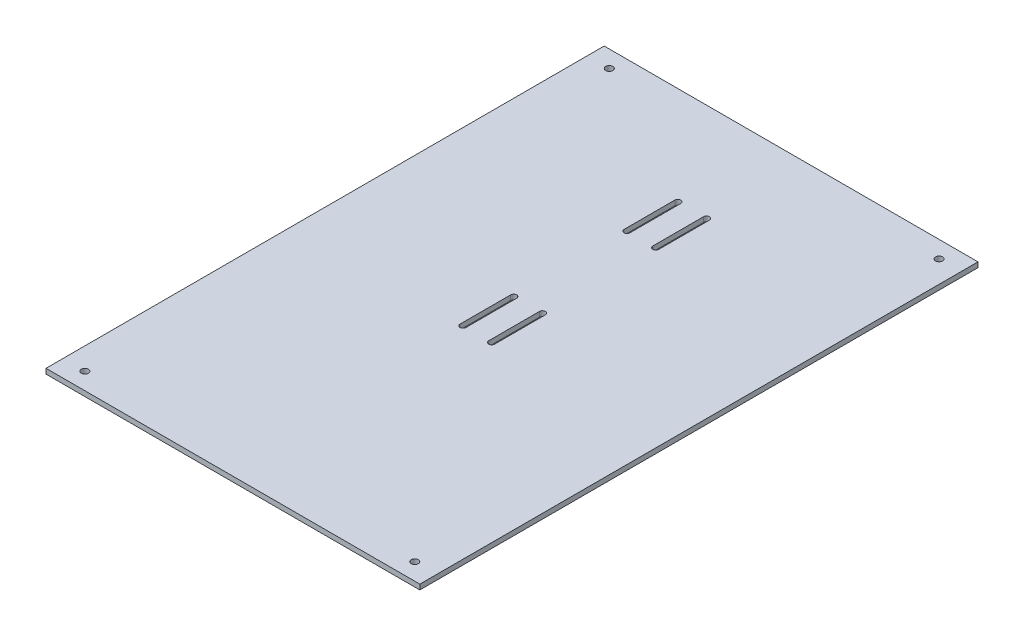
ISO-10303-21;
HEADER;
FILE_DESCRIPTION(('STEP AP214'),'2;1');
FILE_NAME('part.step','',(''),(''),'','','');
FILE_SCHEMA(('AUTOMOTIVE_DESIGN { 1 0 10303 214 1 1 1 1 }'));
ENDSEC;
DATA;
#1=APPLICATION_CONTEXT('core data for automotive mechanical design processes');
#2=APPLICATION_PROTOCOL_DEFINITION('international standard','automotive_design',2000,#1);
#3=PRODUCT_CONTEXT('',#1,'mechanical');
#4=PRODUCT('Part','Part','',(#3));
#5=PRODUCT_RELATED_PRODUCT_CATEGORY('part','',(#4));
#6=PRODUCT_DEFINITION_FORMATION('','',#4);
#7=PRODUCT_DEFINITION_CONTEXT('part definition',#1,'design');
#8=PRODUCT_DEFINITION('design','',#6,#7);
#9=PRODUCT_DEFINITION_SHAPE('','',#8);
#10=(LENGTH_UNIT() NAMED_UNIT(*) SI_UNIT(.MILLI.,.METRE.));
#11=(NAMED_UNIT(*) PLANE_ANGLE_UNIT() SI_UNIT($,.RADIAN.));
#12=(NAMED_UNIT(*) SI_UNIT($,.STERADIAN.) SOLID_ANGLE_UNIT());
#13=UNCERTAINTY_MEASURE_WITH_UNIT(LENGTH_MEASURE(1.E-05),#10,'distance_accuracy_value','');
#14=(GEOMETRIC_REPRESENTATION_CONTEXT(3) GLOBAL_UNCERTAINTY_ASSIGNED_CONTEXT((#13)) GLOBAL_UNIT_ASSIGNED_CONTEXT((#10,
#11,#12)) REPRESENTATION_CONTEXT('',''));
#15=CARTESIAN_POINT('',(0.,0.,0.));
#16=DIRECTION('',(0.,0.,1.));
#17=DIRECTION('',(1.,0.,0.));
#18=AXIS2_PLACEMENT_3D('',#15,#16,#17);
#19=CARTESIAN_POINT('',(110.5,-13.,207.5));
#20=DIRECTION('',(0.,1.,0.));
#21=DIRECTION('',(0.,0.,1.));
#22=AXIS2_PLACEMENT_3D('',#19,#20,#21);
#23=PLANE('',#22);
#24=CARTESIAN_POINT('',(97.5,-13.,-112.5));
#25=DIRECTION('',(0.,-1.,0.));
#26=DIRECTION('',(0.,0.,-1.));
#27=AXIS2_PLACEMENT_3D('',#24,#25,#26);
#28=CIRCLE('',#27,2.1);
#29=CARTESIAN_POINT('',(97.5,-13.,-114.6));
#30=VERTEX_POINT('',#29);
#31=EDGE_CURVE('E218',#30,#30,#28,.T.);
#32=ORIENTED_EDGE('',*,*,#31,.F.);
#33=EDGE_LOOP('',(#32));
#34=FACE_BOUND('',#33,.T.);
#35=DIRECTION('',(0.,0.,-1.));
#36=VECTOR('',#35,1.);
#37=CARTESIAN_POINT('',(-10.7431705127637,-13.,62.5));
#38=LINE('',#37,#36);
#39=CARTESIAN_POINT('',(-10.7431705127637,-13.,62.5));
#40=VERTEX_POINT('',#39);
#41=CARTESIAN_POINT('',(-10.7431705127637,-13.,32.5));
#42=VERTEX_POINT('',#41);
#43=EDGE_CURVE('E202',#40,#42,#38,.T.);
#44=ORIENTED_EDGE('',*,*,#43,.F.);
#45=CARTESIAN_POINT('',(-8.9931705127637,-13.,62.5));
#46=DIRECTION('',(0.,-1.,0.));
#47=DIRECTION('',(0.,0.,-1.));
#48=AXIS2_PLACEMENT_3D('',#45,#46,#47);
#49=CIRCLE('',#48,1.75);
#50=CARTESIAN_POINT('',(-7.2431705127637,-13.,62.5));
#51=VERTEX_POINT('',#50);
#52=EDGE_CURVE('E57',#51,#40,#49,.T.);
#53=ORIENTED_EDGE('',*,*,#52,.F.);
#54=DIRECTION('',(0.,0.,1.));
#55=VECTOR('',#54,1.);
#56=CARTESIAN_POINT('',(-7.2431705127637,-13.,62.5));
#57=LINE('',#56,#55);
#58=CARTESIAN_POINT('',(-7.2431705127637,-13.,32.5));
#59=VERTEX_POINT('',#58);
#60=EDGE_CURVE('E195',#59,#51,#57,.T.);
#61=ORIENTED_EDGE('',*,*,#60,.F.);
#62=CARTESIAN_POINT('',(-8.9931705127637,-13.,32.5));
#63=DIRECTION('',(0.,-1.,0.));
#64=DIRECTION('',(0.,0.,-1.));
#65=AXIS2_PLACEMENT_3D('',#62,#63,#64);
#66=CIRCLE('',#65,1.75);
#67=EDGE_CURVE('E209',#42,#59,#66,.T.);
#68=ORIENTED_EDGE('',*,*,#67,.F.);
#69=EDGE_LOOP('',(#44,#53,#61,#68));
#70=FACE_BOUND('',#69,.T.);
#71=DIRECTION('',(0.,0.,-1.));
#72=VECTOR('',#71,1.);
#73=CARTESIAN_POINT('',(6.25682948723529,-13.,62.4999999999998));
#74=LINE('',#73,#72);
#75=CARTESIAN_POINT('',(6.25682948723529,-13.,62.4999999999998));
#76=VERTEX_POINT('',#75);
#77=CARTESIAN_POINT('',(6.25682948723529,-13.,32.4999999999998));
#78=VERTEX_POINT('',#77);
#79=EDGE_CURVE('E268',#76,#78,#74,.T.);
#80=ORIENTED_EDGE('',*,*,#79,.F.);
#81=CARTESIAN_POINT('',(8.00682948723529,-13.,62.4999999999998));
#82=DIRECTION('',(0.,-1.,0.));
#83=DIRECTION('',(0.,0.,-1.));
#84=AXIS2_PLACEMENT_3D('',#81,#82,#83);
#85=CIRCLE('',#84,1.74999999999999);
#86=CARTESIAN_POINT('',(9.75682948723527,-13.,62.4999999999998));
#87=VERTEX_POINT('',#86);
#88=EDGE_CURVE('E65',#87,#76,#85,.T.);
#89=ORIENTED_EDGE('',*,*,#88,.F.);
#90=DIRECTION('',(0.,0.,1.));
#91=VECTOR('',#90,1.);
#92=CARTESIAN_POINT('',(9.75682948723527,-13.,62.4999999999998));
#93=LINE('',#92,#91);
#94=CARTESIAN_POINT('',(9.75682948723527,-13.,32.4999999999998));
#95=VERTEX_POINT('',#94);
#96=EDGE_CURVE('E274',#95,#87,#93,.T.);
#97=ORIENTED_EDGE('',*,*,#96,.F.);
#98=CARTESIAN_POINT('',(8.00682948723529,-13.,32.4999999999998));
#99=DIRECTION('',(0.,-1.,0.));
#100=DIRECTION('',(0.,0.,-1.));
#101=AXIS2_PLACEMENT_3D('',#98,#99,#100);
#102=CIRCLE('',#101,1.74999999999999);
#103=EDGE_CURVE('E271',#78,#95,#102,.T.);
#104=ORIENTED_EDGE('',*,*,#103,.F.);
#105=EDGE_LOOP('',(#80,#89,#97,#104));
#106=FACE_BOUND('',#105,.T.);
#107=DIRECTION('',(0.,0.,-1.));
#108=VECTOR('',#107,1.);
#109=CARTESIAN_POINT('',(6.25682948723529,-13.,-34.5000000000001));
#110=LINE('',#109,#108);
#111=CARTESIAN_POINT('',(6.25682948723529,-13.,-34.5000000000001));
#112=VERTEX_POINT('',#111);
#113=CARTESIAN_POINT('',(6.2568294872353,-13.,-64.5000000000001));
#114=VERTEX_POINT('',#113);
#115=EDGE_CURVE('E237',#112,#114,#110,.T.);
#116=ORIENTED_EDGE('',*,*,#115,.F.);
#117=CARTESIAN_POINT('',(8.00682948723529,-13.,-34.5000000000001));
#118=DIRECTION('',(0.,-1.,0.));
#119=DIRECTION('',(0.,0.,-1.));
#120=AXIS2_PLACEMENT_3D('',#117,#118,#119);
#121=CIRCLE('',#120,1.75);
#122=CARTESIAN_POINT('',(9.75682948723529,-13.,-34.5000000000001));
#123=VERTEX_POINT('',#122);
#124=EDGE_CURVE('E235',#123,#112,#121,.T.);
#125=ORIENTED_EDGE('',*,*,#124,.F.);
#126=DIRECTION('',(0.,0.,1.));
#127=VECTOR('',#126,1.);
#128=CARTESIAN_POINT('',(9.75682948723529,-13.,-34.5000000000001));
#129=LINE('',#128,#127);
#130=CARTESIAN_POINT('',(9.75682948723529,-13.,-64.5000000000001));
#131=VERTEX_POINT('',#130);
#132=EDGE_CURVE('E243',#131,#123,#129,.T.);
#133=ORIENTED_EDGE('',*,*,#132,.F.);
#134=CARTESIAN_POINT('',(8.0068294872353,-13.,-64.5000000000001));
#135=DIRECTION('',(0.,-1.,0.));
#136=DIRECTION('',(0.,0.,-1.));
#137=AXIS2_PLACEMENT_3D('',#134,#135,#136);
#138=CIRCLE('',#137,1.75);
#139=EDGE_CURVE('E240',#114,#131,#138,.T.);
#140=ORIENTED_EDGE('',*,*,#139,.F.);
#141=EDGE_LOOP('',(#116,#125,#133,#140));
#142=FACE_BOUND('',#141,.T.);
#143=CARTESIAN_POINT('',(-97.5,-13.,197.5));
#144=DIRECTION('',(0.,-1.,0.));
#145=DIRECTION('',(0.,0.,-1.));
#146=AXIS2_PLACEMENT_3D('',#143,#144,#145);
#147=CIRCLE('',#146,2.1);
#148=CARTESIAN_POINT('',(-97.5,-13.,195.4));
#149=VERTEX_POINT('',#148);
#150=EDGE_CURVE('E393',#149,#149,#147,.T.);
#151=ORIENTED_EDGE('',*,*,#150,.F.);
#152=EDGE_LOOP('',(#151));
#153=FACE_BOUND('',#152,.T.);
#154=CARTESIAN_POINT('',(97.5,-13.,197.5));
#155=DIRECTION('',(0.,-1.,0.));
#156=DIRECTION('',(0.,0.,-1.));
#157=AXIS2_PLACEMENT_3D('',#154,#155,#156);
#158=CIRCLE('',#157,2.1);
#159=CARTESIAN_POINT('',(97.5,-13.,195.4));
#160=VERTEX_POINT('',#159);
#161=EDGE_CURVE('E397',#160,#160,#158,.T.);
#162=ORIENTED_EDGE('',*,*,#161,.F.);
#163=EDGE_LOOP('',(#162));
#164=FACE_BOUND('',#163,.T.);
#165=CARTESIAN_POINT('',(-97.5,-13.,-112.5));
#166=DIRECTION('',(0.,-1.,0.));
#167=DIRECTION('',(0.,0.,-1.));
#168=AXIS2_PLACEMENT_3D('',#165,#166,#167);
#169=CIRCLE('',#168,2.1);
#170=CARTESIAN_POINT('',(-97.5,-13.,-114.6));
#171=VERTEX_POINT('',#170);
#172=EDGE_CURVE('E224',#171,#171,#169,.T.);
#173=ORIENTED_EDGE('',*,*,#172,.F.);
#174=EDGE_LOOP('',(#173));
#175=FACE_BOUND('',#174,.T.);
#176=DIRECTION('',(0.,0.,-1.));
#177=VECTOR('',#176,1.);
#178=CARTESIAN_POINT('',(-10.7431705127637,-13.,-34.4999999999999));
#179=LINE('',#178,#177);
#180=CARTESIAN_POINT('',(-10.7431705127637,-13.,-34.5));
#181=VERTEX_POINT('',#180);
#182=CARTESIAN_POINT('',(-10.7431705127637,-13.,-64.4999999999999));
#183=VERTEX_POINT('',#182);
#184=EDGE_CURVE('E297',#181,#183,#179,.T.);
#185=ORIENTED_EDGE('',*,*,#184,.F.);
#186=CARTESIAN_POINT('',(-8.9931705127637,-13.,-34.4999999999999));
#187=DIRECTION('',(0.,-1.,0.));
#188=DIRECTION('',(0.,0.,-1.));
#189=AXIS2_PLACEMENT_3D('',#186,#187,#188);
#190=CIRCLE('',#189,1.75);
#191=CARTESIAN_POINT('',(-7.2431705127637,-13.,-34.4999999999999));
#192=VERTEX_POINT('',#191);
#193=EDGE_CURVE('E295',#192,#181,#190,.T.);
#194=ORIENTED_EDGE('',*,*,#193,.F.);
#195=DIRECTION('',(0.,0.,1.));
#196=VECTOR('',#195,1.);
#197=CARTESIAN_POINT('',(-7.2431705127637,-13.,-34.4999999999999));
#198=LINE('',#197,#196);
#199=CARTESIAN_POINT('',(-7.2431705127637,-13.,-64.4999999999999));
#200=VERTEX_POINT('',#199);
#201=EDGE_CURVE('E303',#200,#192,#198,.T.);
#202=ORIENTED_EDGE('',*,*,#201,.F.);
#203=CARTESIAN_POINT('',(-8.9931705127637,-13.,-64.4999999999999));
#204=DIRECTION('',(0.,-1.,0.));
#205=DIRECTION('',(0.,0.,-1.));
#206=AXIS2_PLACEMENT_3D('',#203,#204,#205);
#207=CIRCLE('',#206,1.75);
#208=EDGE_CURVE('E300',#183,#200,#207,.T.);
#209=ORIENTED_EDGE('',*,*,#208,.F.);
#210=EDGE_LOOP('',(#185,#194,#202,#209));
#211=FACE_BOUND('',#210,.T.);
#212=DIRECTION('',(-1.,0.,0.));
#213=VECTOR('',#212,1.);
#214=CARTESIAN_POINT('',(110.5,-13.,207.5));
#215=LINE('',#214,#213);
#216=CARTESIAN_POINT('',(110.5,-13.,207.5));
#217=VERTEX_POINT('',#216);
#218=CARTESIAN_POINT('',(-110.5,-13.,207.5));
#219=VERTEX_POINT('',#218);
#220=EDGE_CURVE('E341',#217,#219,#215,.T.);
#221=ORIENTED_EDGE('',*,*,#220,.T.);
#222=DIRECTION('',(0.,0.,-1.));
#223=VECTOR('',#222,1.);
#224=CARTESIAN_POINT('',(-110.5,-13.,207.5));
#225=LINE('',#224,#223);
#226=CARTESIAN_POINT('',(-110.5,-13.,-122.5));
#227=VERTEX_POINT('',#226);
#228=EDGE_CURVE('E318',#219,#227,#225,.T.);
#229=ORIENTED_EDGE('',*,*,#228,.T.);
#230=DIRECTION('',(-1.,0.,0.));
#231=VECTOR('',#230,1.);
#232=CARTESIAN_POINT('',(110.5,-13.,-122.5));
#233=LINE('',#232,#231);
#234=CARTESIAN_POINT('',(110.5,-13.,-122.5));
#235=VERTEX_POINT('',#234);
#236=EDGE_CURVE('E11',#235,#227,#233,.T.);
#237=ORIENTED_EDGE('',*,*,#236,.F.);
#238=DIRECTION('',(0.,0.,-1.));
#239=VECTOR('',#238,1.);
#240=CARTESIAN_POINT('',(110.5,-13.,207.5));
#241=LINE('',#240,#239);
#242=EDGE_CURVE('E330',#217,#235,#241,.T.);
#243=ORIENTED_EDGE('',*,*,#242,.F.);
#244=EDGE_LOOP('',(#221,#229,#237,#243));
#245=FACE_BOUND('',#244,.T.);
#246=ADVANCED_FACE('F43',(#34,#70,#106,#142,#153,#164,#175,#211,#245),#23,.F.);
#247=CARTESIAN_POINT('',(110.5,-10.,-122.5));
#248=DIRECTION('',(0.,0.,-1.));
#249=DIRECTION('',(0.,1.,0.));
#250=AXIS2_PLACEMENT_3D('',#247,#248,#249);
#251=PLANE('',#250);
#252=ORIENTED_EDGE('',*,*,#236,.T.);
#253=DIRECTION('',(0.,-1.,0.));
#254=VECTOR('',#253,1.);
#255=CARTESIAN_POINT('',(-110.5,-10.,-122.5));
#256=LINE('',#255,#254);
#257=CARTESIAN_POINT('',(-110.5,-10.,-122.5));
#258=VERTEX_POINT('',#257);
#259=EDGE_CURVE('E321',#258,#227,#256,.T.);
#260=ORIENTED_EDGE('',*,*,#259,.F.);
#261=DIRECTION('',(-1.,0.,0.));
#262=VECTOR('',#261,1.);
#263=CARTESIAN_POINT('',(110.5,-10.,-122.5));
#264=LINE('',#263,#262);
#265=CARTESIAN_POINT('',(110.5,-10.,-122.5));
#266=VERTEX_POINT('',#265);
#267=EDGE_CURVE('E50',#266,#258,#264,.T.);
#268=ORIENTED_EDGE('',*,*,#267,.F.);
#269=DIRECTION('',(0.,-1.,0.));
#270=VECTOR('',#269,1.);
#271=CARTESIAN_POINT('',(110.5,-10.,-122.5));
#272=LINE('',#271,#270);
#273=EDGE_CURVE('E332',#266,#235,#272,.T.);
#274=ORIENTED_EDGE('',*,*,#273,.T.);
#275=EDGE_LOOP('',(#252,#260,#268,#274));
#276=FACE_BOUND('',#275,.T.);
#277=ADVANCED_FACE('F354',(#276),#251,.T.);
#278=CARTESIAN_POINT('',(110.5,-10.,207.5));
#279=DIRECTION('',(0.,1.,0.));
#280=DIRECTION('',(0.,0.,1.));
#281=AXIS2_PLACEMENT_3D('',#278,#279,#280);
#282=PLANE('',#281);
#283=CARTESIAN_POINT('',(97.5,-10.,-112.5));
#284=DIRECTION('',(0.,1.,0.));
#285=DIRECTION('',(0.,0.,1.));
#286=AXIS2_PLACEMENT_3D('',#283,#284,#285);
#287=CIRCLE('',#286,2.1);
#288=CARTESIAN_POINT('',(97.5,-10.,-110.4));
#289=VERTEX_POINT('',#288);
#290=EDGE_CURVE('E221',#289,#289,#287,.F.);
#291=ORIENTED_EDGE('',*,*,#290,.T.);
#292=EDGE_LOOP('',(#291));
#293=FACE_BOUND('',#292,.T.);
#294=CARTESIAN_POINT('',(-8.9931705127637,-10.,62.5));
#295=DIRECTION('',(0.,1.,0.));
#296=DIRECTION('',(0.,0.,1.));
#297=AXIS2_PLACEMENT_3D('',#294,#295,#296);
#298=CIRCLE('',#297,1.75);
#299=CARTESIAN_POINT('',(-7.2431705127637,-10.,62.5));
#300=VERTEX_POINT('',#299);
#301=CARTESIAN_POINT('',(-10.7431705127637,-10.,62.5));
#302=VERTEX_POINT('',#301);
#303=EDGE_CURVE('E193',#300,#302,#298,.F.);
#304=ORIENTED_EDGE('',*,*,#303,.T.);
#305=DIRECTION('',(0.,0.,-1.));
#306=VECTOR('',#305,1.);
#307=CARTESIAN_POINT('',(-10.7431705127637,-10.,62.5));
#308=LINE('',#307,#306);
#309=CARTESIAN_POINT('',(-10.7431705127637,-10.,32.5));
#310=VERTEX_POINT('',#309);
#311=EDGE_CURVE('E179',#302,#310,#308,.T.);
#312=ORIENTED_EDGE('',*,*,#311,.T.);
#313=CARTESIAN_POINT('',(-8.9931705127637,-10.,32.5));
#314=DIRECTION('',(0.,1.,0.));
#315=DIRECTION('',(0.,0.,1.));
#316=AXIS2_PLACEMENT_3D('',#313,#314,#315);
#317=CIRCLE('',#316,1.75);
#318=CARTESIAN_POINT('',(-7.2431705127637,-10.,32.5));
#319=VERTEX_POINT('',#318);
#320=EDGE_CURVE('E204',#310,#319,#317,.F.);
#321=ORIENTED_EDGE('',*,*,#320,.T.);
#322=DIRECTION('',(0.,0.,1.));
#323=VECTOR('',#322,1.);
#324=CARTESIAN_POINT('',(-7.2431705127637,-10.,62.5));
#325=LINE('',#324,#323);
#326=EDGE_CURVE('E200',#319,#300,#325,.T.);
#327=ORIENTED_EDGE('',*,*,#326,.T.);
#328=EDGE_LOOP('',(#304,#312,#321,#327));
#329=FACE_BOUND('',#328,.T.);
#330=CARTESIAN_POINT('',(8.00682948723529,-10.,62.4999999999998));
#331=DIRECTION('',(0.,1.,0.));
#332=DIRECTION('',(0.,0.,1.));
#333=AXIS2_PLACEMENT_3D('',#330,#331,#332);
#334=CIRCLE('',#333,1.74999999999999);
#335=CARTESIAN_POINT('',(9.75682948723527,-10.,62.4999999999998));
#336=VERTEX_POINT('',#335);
#337=CARTESIAN_POINT('',(6.25682948723529,-10.,62.4999999999998));
#338=VERTEX_POINT('',#337);
#339=EDGE_CURVE('E264',#336,#338,#334,.F.);
#340=ORIENTED_EDGE('',*,*,#339,.T.);
#341=DIRECTION('',(0.,0.,-1.));
#342=VECTOR('',#341,1.);
#343=CARTESIAN_POINT('',(6.25682948723529,-10.,62.4999999999998));
#344=LINE('',#343,#342);
#345=CARTESIAN_POINT('',(6.25682948723529,-10.,32.4999999999998));
#346=VERTEX_POINT('',#345);
#347=EDGE_CURVE('E229',#338,#346,#344,.T.);
#348=ORIENTED_EDGE('',*,*,#347,.T.);
#349=CARTESIAN_POINT('',(8.00682948723529,-10.,32.4999999999998));
#350=DIRECTION('',(0.,1.,0.));
#351=DIRECTION('',(0.,0.,1.));
#352=AXIS2_PLACEMENT_3D('',#349,#350,#351);
#353=CIRCLE('',#352,1.74999999999999);
#354=CARTESIAN_POINT('',(9.75682948723528,-10.,32.4999999999998));
#355=VERTEX_POINT('',#354);
#356=EDGE_CURVE('E189',#346,#355,#353,.F.);
#357=ORIENTED_EDGE('',*,*,#356,.T.);
#358=DIRECTION('',(0.,0.,1.));
#359=VECTOR('',#358,1.);
#360=CARTESIAN_POINT('',(9.75682948723527,-10.,62.4999999999998));
#361=LINE('',#360,#359);
#362=EDGE_CURVE('E261',#355,#336,#361,.T.);
#363=ORIENTED_EDGE('',*,*,#362,.T.);
#364=EDGE_LOOP('',(#340,#348,#357,#363));
#365=FACE_BOUND('',#364,.T.);
#366=CARTESIAN_POINT('',(8.00682948723529,-10.,-34.5000000000001));
#367=DIRECTION('',(0.,1.,0.));
#368=DIRECTION('',(0.,0.,1.));
#369=AXIS2_PLACEMENT_3D('',#366,#367,#368);
#370=CIRCLE('',#369,1.75);
#371=CARTESIAN_POINT('',(9.75682948723529,-10.,-34.5000000000001));
#372=VERTEX_POINT('',#371);
#373=CARTESIAN_POINT('',(6.25682948723529,-10.,-34.5000000000001));
#374=VERTEX_POINT('',#373);
#375=EDGE_CURVE('E232',#372,#374,#370,.F.);
#376=ORIENTED_EDGE('',*,*,#375,.T.);
#377=DIRECTION('',(0.,0.,-1.));
#378=VECTOR('',#377,1.);
#379=CARTESIAN_POINT('',(6.25682948723529,-10.,-34.5000000000001));
#380=LINE('',#379,#378);
#381=CARTESIAN_POINT('',(6.25682948723528,-10.,-64.5000000000001));
#382=VERTEX_POINT('',#381);
#383=EDGE_CURVE('E249',#374,#382,#380,.T.);
#384=ORIENTED_EDGE('',*,*,#383,.T.);
#385=CARTESIAN_POINT('',(8.0068294872353,-10.,-64.5000000000001));
#386=DIRECTION('',(0.,1.,0.));
#387=DIRECTION('',(0.,0.,1.));
#388=AXIS2_PLACEMENT_3D('',#385,#386,#387);
#389=CIRCLE('',#388,1.75);
#390=CARTESIAN_POINT('',(9.7568294872353,-10.,-64.5000000000001));
#391=VERTEX_POINT('',#390);
#392=EDGE_CURVE('E225',#382,#391,#389,.F.);
#393=ORIENTED_EDGE('',*,*,#392,.T.);
#394=DIRECTION('',(0.,0.,1.));
#395=VECTOR('',#394,1.);
#396=CARTESIAN_POINT('',(9.75682948723529,-10.,-34.5000000000001));
#397=LINE('',#396,#395);
#398=EDGE_CURVE('E228',#391,#372,#397,.T.);
#399=ORIENTED_EDGE('',*,*,#398,.T.);
#400=EDGE_LOOP('',(#376,#384,#393,#399));
#401=FACE_BOUND('',#400,.T.);
#402=CARTESIAN_POINT('',(-97.5,-10.,197.5));
#403=DIRECTION('',(0.,1.,0.));
#404=DIRECTION('',(0.,0.,1.));
#405=AXIS2_PLACEMENT_3D('',#402,#403,#404);
#406=CIRCLE('',#405,2.1);
#407=CARTESIAN_POINT('',(-97.5,-10.,199.6));
#408=VERTEX_POINT('',#407);
#409=EDGE_CURVE('E690',#408,#408,#406,.F.);
#410=ORIENTED_EDGE('',*,*,#409,.T.);
#411=EDGE_LOOP('',(#410));
#412=FACE_BOUND('',#411,.T.);
#413=CARTESIAN_POINT('',(97.5,-10.,197.5));
#414=DIRECTION('',(0.,1.,0.));
#415=DIRECTION('',(0.,0.,1.));
#416=AXIS2_PLACEMENT_3D('',#413,#414,#415);
#417=CIRCLE('',#416,2.1);
#418=CARTESIAN_POINT('',(97.5,-10.,199.6));
#419=VERTEX_POINT('',#418);
#420=EDGE_CURVE('E682',#419,#419,#417,.F.);
#421=ORIENTED_EDGE('',*,*,#420,.T.);
#422=EDGE_LOOP('',(#421));
#423=FACE_BOUND('',#422,.T.);
#424=CARTESIAN_POINT('',(-97.5,-10.,-112.5));
#425=DIRECTION('',(0.,1.,0.));
#426=DIRECTION('',(0.,0.,1.));
#427=AXIS2_PLACEMENT_3D('',#424,#425,#426);
#428=CIRCLE('',#427,2.1);
#429=CARTESIAN_POINT('',(-97.5,-10.,-110.4));
#430=VERTEX_POINT('',#429);
#431=EDGE_CURVE('E686',#430,#430,#428,.F.);
#432=ORIENTED_EDGE('',*,*,#431,.T.);
#433=EDGE_LOOP('',(#432));
#434=FACE_BOUND('',#433,.T.);
#435=CARTESIAN_POINT('',(-8.9931705127637,-10.,-34.4999999999999));
#436=DIRECTION('',(0.,1.,0.));
#437=DIRECTION('',(0.,0.,1.));
#438=AXIS2_PLACEMENT_3D('',#435,#436,#437);
#439=CIRCLE('',#438,1.75);
#440=CARTESIAN_POINT('',(-7.2431705127637,-10.,-34.4999999999999));
#441=VERTEX_POINT('',#440);
#442=CARTESIAN_POINT('',(-10.7431705127637,-10.,-34.4999999999999));
#443=VERTEX_POINT('',#442);
#444=EDGE_CURVE('E292',#441,#443,#439,.F.);
#445=ORIENTED_EDGE('',*,*,#444,.T.);
#446=DIRECTION('',(0.,0.,-1.));
#447=VECTOR('',#446,1.);
#448=CARTESIAN_POINT('',(-10.7431705127637,-10.,-34.4999999999999));
#449=LINE('',#448,#447);
#450=CARTESIAN_POINT('',(-10.7431705127637,-10.,-64.5));
#451=VERTEX_POINT('',#450);
#452=EDGE_CURVE('E309',#443,#451,#449,.T.);
#453=ORIENTED_EDGE('',*,*,#452,.T.);
#454=CARTESIAN_POINT('',(-8.9931705127637,-10.,-64.4999999999999));
#455=DIRECTION('',(0.,1.,0.));
#456=DIRECTION('',(0.,0.,1.));
#457=AXIS2_PLACEMENT_3D('',#454,#455,#456);
#458=CIRCLE('',#457,1.75);
#459=CARTESIAN_POINT('',(-7.2431705127637,-10.,-64.4999999999999));
#460=VERTEX_POINT('',#459);
#461=EDGE_CURVE('E258',#451,#460,#458,.F.);
#462=ORIENTED_EDGE('',*,*,#461,.T.);
#463=DIRECTION('',(0.,0.,1.));
#464=VECTOR('',#463,1.);
#465=CARTESIAN_POINT('',(-7.2431705127637,-10.,-34.4999999999999));
#466=LINE('',#465,#464);
#467=EDGE_CURVE('E289',#460,#441,#466,.T.);
#468=ORIENTED_EDGE('',*,*,#467,.T.);
#469=EDGE_LOOP('',(#445,#453,#462,#468));
#470=FACE_BOUND('',#469,.T.);
#471=ORIENTED_EDGE('',*,*,#267,.T.);
#472=DIRECTION('',(0.,0.,-1.));
#473=VECTOR('',#472,1.);
#474=CARTESIAN_POINT('',(-110.5,-10.,207.5));
#475=LINE('',#474,#473);
#476=CARTESIAN_POINT('',(-110.5,-10.,207.5));
#477=VERTEX_POINT('',#476);
#478=EDGE_CURVE('E324',#477,#258,#475,.T.);
#479=ORIENTED_EDGE('',*,*,#478,.F.);
#480=DIRECTION('',(-1.,0.,0.));
#481=VECTOR('',#480,1.);
#482=CARTESIAN_POINT('',(110.5,-10.,207.5));
#483=LINE('',#482,#481);
#484=CARTESIAN_POINT('',(110.5,-10.,207.5));
#485=VERTEX_POINT('',#484);
#486=EDGE_CURVE('E343',#485,#477,#483,.T.);
#487=ORIENTED_EDGE('',*,*,#486,.F.);
#488=DIRECTION('',(0.,0.,-1.));
#489=VECTOR('',#488,1.);
#490=CARTESIAN_POINT('',(110.5,-10.,207.5));
#491=LINE('',#490,#489);
#492=EDGE_CURVE('E335',#485,#266,#491,.T.);
#493=ORIENTED_EDGE('',*,*,#492,.T.);
#494=EDGE_LOOP('',(#471,#479,#487,#493));
#495=FACE_BOUND('',#494,.T.);
#496=ADVANCED_FACE('F198',(#293,#329,#365,#401,#412,#423,#434,#470,#495),#282,.T.);
#497=CARTESIAN_POINT('',(110.5,-13.,207.5));
#498=DIRECTION('',(0.,0.,1.));
#499=DIRECTION('',(1.,0.,0.));
#500=AXIS2_PLACEMENT_3D('',#497,#498,#499);
#501=PLANE('',#500);
#502=ORIENTED_EDGE('',*,*,#486,.T.);
#503=DIRECTION('',(0.,1.,0.));
#504=VECTOR('',#503,1.);
#505=CARTESIAN_POINT('',(-110.5,-13.,207.5));
#506=LINE('',#505,#504);
#507=EDGE_CURVE('E327',#219,#477,#506,.T.);
#508=ORIENTED_EDGE('',*,*,#507,.F.);
#509=ORIENTED_EDGE('',*,*,#220,.F.);
#510=DIRECTION('',(0.,1.,0.));
#511=VECTOR('',#510,1.);
#512=CARTESIAN_POINT('',(110.5,-13.,207.5));
#513=LINE('',#512,#511);
#514=EDGE_CURVE('E338',#217,#485,#513,.T.);
#515=ORIENTED_EDGE('',*,*,#514,.T.);
#516=EDGE_LOOP('',(#502,#508,#509,#515));
#517=FACE_BOUND('',#516,.T.);
#518=ADVANCED_FACE('F360',(#517),#501,.T.);
#519=CARTESIAN_POINT('',(110.5,0.,0.));
#520=DIRECTION('',(-1.,0.,0.));
#521=DIRECTION('',(0.,0.,1.));
#522=AXIS2_PLACEMENT_3D('',#519,#520,#521);
#523=PLANE('',#522);
#524=ORIENTED_EDGE('',*,*,#242,.T.);
#525=ORIENTED_EDGE('',*,*,#273,.F.);
#526=ORIENTED_EDGE('',*,*,#492,.F.);
#527=ORIENTED_EDGE('',*,*,#514,.F.);
#528=EDGE_LOOP('',(#524,#525,#526,#527));
#529=FACE_BOUND('',#528,.T.);
#530=ADVANCED_FACE('F362',(#529),#523,.F.);
#531=CARTESIAN_POINT('',(-110.5,0.,0.));
#532=DIRECTION('',(-1.,0.,0.));
#533=DIRECTION('',(0.,0.,1.));
#534=AXIS2_PLACEMENT_3D('',#531,#532,#533);
#535=PLANE('',#534);
#536=ORIENTED_EDGE('',*,*,#228,.F.);
#537=ORIENTED_EDGE('',*,*,#507,.T.);
#538=ORIENTED_EDGE('',*,*,#478,.T.);
#539=ORIENTED_EDGE('',*,*,#259,.T.);
#540=EDGE_LOOP('',(#536,#537,#538,#539));
#541=FACE_BOUND('',#540,.T.);
#542=ADVANCED_FACE('F352',(#541),#535,.T.);
#543=CARTESIAN_POINT('',(-8.9931705127637,-9.99900000000001,-34.4999999999999));
#544=DIRECTION('',(0.,-1.,0.));
#545=DIRECTION('',(0.,0.,-1.));
#546=AXIS2_PLACEMENT_3D('',#543,#544,#545);
#547=CYLINDRICAL_SURFACE('',#546,1.75);
#548=DIRECTION('',(0.,-1.,0.));
#549=VECTOR('',#548,1.);
#550=CARTESIAN_POINT('',(-7.2431705127637,-9.99900000000001,-34.4999999999999));
#551=LINE('',#550,#549);
#552=EDGE_CURVE('E307',#441,#192,#551,.T.);
#553=ORIENTED_EDGE('',*,*,#552,.T.);
#554=ORIENTED_EDGE('',*,*,#193,.T.);
#555=DIRECTION('',(0.,-1.,0.));
#556=VECTOR('',#555,1.);
#557=CARTESIAN_POINT('',(-10.7431705127637,-9.99900000000001,-34.4999999999999));
#558=LINE('',#557,#556);
#559=EDGE_CURVE('E306',#443,#181,#558,.T.);
#560=ORIENTED_EDGE('',*,*,#559,.F.);
#561=ORIENTED_EDGE('',*,*,#444,.F.);
#562=EDGE_LOOP('',(#553,#554,#560,#561));
#563=FACE_BOUND('',#562,.T.);
#564=ADVANCED_FACE('F369',(#563),#547,.F.);
#565=CARTESIAN_POINT('',(-7.2431705127637,-9.99900000000001,-34.4999999999999));
#566=DIRECTION('',(1.,0.,0.));
#567=DIRECTION('',(0.,0.,-1.));
#568=AXIS2_PLACEMENT_3D('',#565,#566,#567);
#569=PLANE('',#568);
#570=DIRECTION('',(0.,-1.,0.));
#571=VECTOR('',#570,1.);
#572=CARTESIAN_POINT('',(-7.2431705127637,-9.99900000000001,-64.4999999999999));
#573=LINE('',#572,#571);
#574=EDGE_CURVE('E310',#460,#200,#573,.T.);
#575=ORIENTED_EDGE('',*,*,#574,.T.);
#576=ORIENTED_EDGE('',*,*,#201,.T.);
#577=ORIENTED_EDGE('',*,*,#552,.F.);
#578=ORIENTED_EDGE('',*,*,#467,.F.);
#579=EDGE_LOOP('',(#575,#576,#577,#578));
#580=FACE_BOUND('',#579,.T.);
#581=ADVANCED_FACE('F414',(#580),#569,.F.);
#582=CARTESIAN_POINT('',(-8.9931705127637,-9.99900000000001,-64.4999999999999));
#583=DIRECTION('',(0.,-1.,0.));
#584=DIRECTION('',(0.,0.,-1.));
#585=AXIS2_PLACEMENT_3D('',#582,#583,#584);
#586=CYLINDRICAL_SURFACE('',#585,1.75);
#587=DIRECTION('',(0.,-1.,0.));
#588=VECTOR('',#587,1.);
#589=CARTESIAN_POINT('',(-10.7431705127637,-9.99900000000001,-64.4999999999999));
#590=LINE('',#589,#588);
#591=EDGE_CURVE('E312',#451,#183,#590,.T.);
#592=ORIENTED_EDGE('',*,*,#591,.T.);
#593=ORIENTED_EDGE('',*,*,#208,.T.);
#594=ORIENTED_EDGE('',*,*,#574,.F.);
#595=ORIENTED_EDGE('',*,*,#461,.F.);
#596=EDGE_LOOP('',(#592,#593,#594,#595));
#597=FACE_BOUND('',#596,.T.);
#598=ADVANCED_FACE('F416',(#597),#586,.F.);
#599=CARTESIAN_POINT('',(-10.7431705127637,-9.99900000000001,-34.4999999999999));
#600=DIRECTION('',(-1.,0.,0.));
#601=DIRECTION('',(0.,0.,1.));
#602=AXIS2_PLACEMENT_3D('',#599,#600,#601);
#603=PLANE('',#602);
#604=ORIENTED_EDGE('',*,*,#559,.T.);
#605=ORIENTED_EDGE('',*,*,#184,.T.);
#606=ORIENTED_EDGE('',*,*,#591,.F.);
#607=ORIENTED_EDGE('',*,*,#452,.F.);
#608=EDGE_LOOP('',(#604,#605,#606,#607));
#609=FACE_BOUND('',#608,.T.);
#610=ADVANCED_FACE('F406',(#609),#603,.F.);
#611=CARTESIAN_POINT('',(-97.5,-9.99900000000001,-112.5));
#612=DIRECTION('',(0.,-1.,0.));
#613=DIRECTION('',(0.,0.,-1.));
#614=AXIS2_PLACEMENT_3D('',#611,#612,#613);
#615=CYLINDRICAL_SURFACE('',#614,2.1);
#616=ORIENTED_EDGE('',*,*,#431,.F.);
#617=EDGE_LOOP('',(#616));
#618=FACE_BOUND('',#617,.T.);
#619=ORIENTED_EDGE('',*,*,#172,.T.);
#620=EDGE_LOOP('',(#619));
#621=FACE_BOUND('',#620,.T.);
#622=ADVANCED_FACE('F423',(#618,#621),#615,.F.);
#623=CARTESIAN_POINT('',(97.5,-9.99900000000001,197.5));
#624=DIRECTION('',(0.,-1.,0.));
#625=DIRECTION('',(0.,0.,-1.));
#626=AXIS2_PLACEMENT_3D('',#623,#624,#625);
#627=CYLINDRICAL_SURFACE('',#626,2.1);
#628=ORIENTED_EDGE('',*,*,#420,.F.);
#629=EDGE_LOOP('',(#628));
#630=FACE_BOUND('',#629,.T.);
#631=ORIENTED_EDGE('',*,*,#161,.T.);
#632=EDGE_LOOP('',(#631));
#633=FACE_BOUND('',#632,.T.);
#634=ADVANCED_FACE('F458',(#630,#633),#627,.F.);
#635=CARTESIAN_POINT('',(-97.5,-9.99900000000001,197.5));
#636=DIRECTION('',(0.,-1.,0.));
#637=DIRECTION('',(0.,0.,-1.));
#638=AXIS2_PLACEMENT_3D('',#635,#636,#637);
#639=CYLINDRICAL_SURFACE('',#638,2.1);
#640=ORIENTED_EDGE('',*,*,#409,.F.);
#641=EDGE_LOOP('',(#640));
#642=FACE_BOUND('',#641,.T.);
#643=ORIENTED_EDGE('',*,*,#150,.T.);
#644=EDGE_LOOP('',(#643));
#645=FACE_BOUND('',#644,.T.);
#646=ADVANCED_FACE('F469',(#642,#645),#639,.F.);
#647=CARTESIAN_POINT('',(8.00682948723529,-9.99900000000001,-34.5000000000001));
#648=DIRECTION('',(0.,-1.,0.));
#649=DIRECTION('',(0.,0.,-1.));
#650=AXIS2_PLACEMENT_3D('',#647,#648,#649);
#651=CYLINDRICAL_SURFACE('',#650,1.75);
#652=DIRECTION('',(0.,-1.,0.));
#653=VECTOR('',#652,1.);
#654=CARTESIAN_POINT('',(9.75682948723529,-9.99900000000001,-34.5000000000001));
#655=LINE('',#654,#653);
#656=EDGE_CURVE('E247',#372,#123,#655,.T.);
#657=ORIENTED_EDGE('',*,*,#656,.T.);
#658=ORIENTED_EDGE('',*,*,#124,.T.);
#659=DIRECTION('',(0.,-1.,0.));
#660=VECTOR('',#659,1.);
#661=CARTESIAN_POINT('',(6.25682948723529,-9.99900000000001,-34.5000000000001));
#662=LINE('',#661,#660);
#663=EDGE_CURVE('E246',#374,#112,#662,.T.);
#664=ORIENTED_EDGE('',*,*,#663,.F.);
#665=ORIENTED_EDGE('',*,*,#375,.F.);
#666=EDGE_LOOP('',(#657,#658,#664,#665));
#667=FACE_BOUND('',#666,.T.);
#668=ADVANCED_FACE('F480',(#667),#651,.F.);
#669=CARTESIAN_POINT('',(9.75682948723529,-9.99900000000001,-34.5000000000001));
#670=DIRECTION('',(1.,0.,0.));
#671=DIRECTION('',(0.,0.,-1.));
#672=AXIS2_PLACEMENT_3D('',#669,#670,#671);
#673=PLANE('',#672);
#674=DIRECTION('',(0.,-1.,0.));
#675=VECTOR('',#674,1.);
#676=CARTESIAN_POINT('',(9.75682948723529,-9.99900000000001,-64.5000000000001));
#677=LINE('',#676,#675);
#678=EDGE_CURVE('E250',#391,#131,#677,.T.);
#679=ORIENTED_EDGE('',*,*,#678,.T.);
#680=ORIENTED_EDGE('',*,*,#132,.T.);
#681=ORIENTED_EDGE('',*,*,#656,.F.);
#682=ORIENTED_EDGE('',*,*,#398,.F.);
#683=EDGE_LOOP('',(#679,#680,#681,#682));
#684=FACE_BOUND('',#683,.T.);
#685=ADVANCED_FACE('F491',(#684),#673,.F.);
#686=CARTESIAN_POINT('',(8.0068294872353,-9.99900000000001,-64.5000000000001));
#687=DIRECTION('',(0.,-1.,0.));
#688=DIRECTION('',(0.,0.,-1.));
#689=AXIS2_PLACEMENT_3D('',#686,#687,#688);
#690=CYLINDRICAL_SURFACE('',#689,1.75);
#691=DIRECTION('',(0.,-1.,0.));
#692=VECTOR('',#691,1.);
#693=CARTESIAN_POINT('',(6.2568294872353,-9.99900000000001,-64.5000000000001));
#694=LINE('',#693,#692);
#695=EDGE_CURVE('E252',#382,#114,#694,.T.);
#696=ORIENTED_EDGE('',*,*,#695,.T.);
#697=ORIENTED_EDGE('',*,*,#139,.T.);
#698=ORIENTED_EDGE('',*,*,#678,.F.);
#699=ORIENTED_EDGE('',*,*,#392,.F.);
#700=EDGE_LOOP('',(#696,#697,#698,#699));
#701=FACE_BOUND('',#700,.T.);
#702=ADVANCED_FACE('F502',(#701),#690,.F.);
#703=CARTESIAN_POINT('',(6.25682948723529,-9.99900000000001,-34.5000000000001));
#704=DIRECTION('',(-1.,0.,0.));
#705=DIRECTION('',(0.,0.,1.));
#706=AXIS2_PLACEMENT_3D('',#703,#704,#705);
#707=PLANE('',#706);
#708=ORIENTED_EDGE('',*,*,#663,.T.);
#709=ORIENTED_EDGE('',*,*,#115,.T.);
#710=ORIENTED_EDGE('',*,*,#695,.F.);
#711=ORIENTED_EDGE('',*,*,#383,.F.);
#712=EDGE_LOOP('',(#708,#709,#710,#711));
#713=FACE_BOUND('',#712,.T.);
#714=ADVANCED_FACE('F513',(#713),#707,.F.);
#715=CARTESIAN_POINT('',(8.00682948723529,-9.99900000000001,62.4999999999998));
#716=DIRECTION('',(0.,-1.,0.));
#717=DIRECTION('',(0.,0.,-1.));
#718=AXIS2_PLACEMENT_3D('',#715,#716,#717);
#719=CYLINDRICAL_SURFACE('',#718,1.74999999999999);
#720=DIRECTION('',(0.,-1.,0.));
#721=VECTOR('',#720,1.);
#722=CARTESIAN_POINT('',(9.75682948723527,-9.99900000000001,62.4999999999998));
#723=LINE('',#722,#721);
#724=EDGE_CURVE('E278',#336,#87,#723,.T.);
#725=ORIENTED_EDGE('',*,*,#724,.T.);
#726=ORIENTED_EDGE('',*,*,#88,.T.);
#727=DIRECTION('',(0.,-1.,0.));
#728=VECTOR('',#727,1.);
#729=CARTESIAN_POINT('',(6.25682948723529,-9.99900000000001,62.4999999999998));
#730=LINE('',#729,#728);
#731=EDGE_CURVE('E277',#338,#76,#730,.T.);
#732=ORIENTED_EDGE('',*,*,#731,.F.);
#733=ORIENTED_EDGE('',*,*,#339,.F.);
#734=EDGE_LOOP('',(#725,#726,#732,#733));
#735=FACE_BOUND('',#734,.T.);
#736=ADVANCED_FACE('F524',(#735),#719,.F.);
#737=CARTESIAN_POINT('',(9.75682948723527,-9.99900000000001,62.4999999999998));
#738=DIRECTION('',(1.,0.,0.));
#739=DIRECTION('',(0.,0.,-1.));
#740=AXIS2_PLACEMENT_3D('',#737,#738,#739);
#741=PLANE('',#740);
#742=DIRECTION('',(0.,-1.,0.));
#743=VECTOR('',#742,1.);
#744=CARTESIAN_POINT('',(9.75682948723527,-9.99900000000001,32.4999999999998));
#745=LINE('',#744,#743);
#746=EDGE_CURVE('E280',#355,#95,#745,.T.);
#747=ORIENTED_EDGE('',*,*,#746,.T.);
#748=ORIENTED_EDGE('',*,*,#96,.T.);
#749=ORIENTED_EDGE('',*,*,#724,.F.);
#750=ORIENTED_EDGE('',*,*,#362,.F.);
#751=EDGE_LOOP('',(#747,#748,#749,#750));
#752=FACE_BOUND('',#751,.T.);
#753=ADVANCED_FACE('F535',(#752),#741,.F.);
#754=CARTESIAN_POINT('',(8.00682948723529,-9.99900000000001,32.4999999999998));
#755=DIRECTION('',(0.,-1.,0.));
#756=DIRECTION('',(0.,0.,-1.));
#757=AXIS2_PLACEMENT_3D('',#754,#755,#756);
#758=CYLINDRICAL_SURFACE('',#757,1.74999999999999);
#759=DIRECTION('',(0.,-1.,0.));
#760=VECTOR('',#759,1.);
#761=CARTESIAN_POINT('',(6.25682948723529,-9.99900000000001,32.4999999999998));
#762=LINE('',#761,#760);
#763=EDGE_CURVE('E282',#346,#78,#762,.T.);
#764=ORIENTED_EDGE('',*,*,#763,.T.);
#765=ORIENTED_EDGE('',*,*,#103,.T.);
#766=ORIENTED_EDGE('',*,*,#746,.F.);
#767=ORIENTED_EDGE('',*,*,#356,.F.);
#768=EDGE_LOOP('',(#764,#765,#766,#767));
#769=FACE_BOUND('',#768,.T.);
#770=ADVANCED_FACE('F544',(#769),#758,.F.);
#771=CARTESIAN_POINT('',(6.25682948723529,-9.99900000000001,62.4999999999998));
#772=DIRECTION('',(-1.,0.,0.));
#773=DIRECTION('',(0.,0.,1.));
#774=AXIS2_PLACEMENT_3D('',#771,#772,#773);
#775=PLANE('',#774);
#776=ORIENTED_EDGE('',*,*,#731,.T.);
#777=ORIENTED_EDGE('',*,*,#79,.T.);
#778=ORIENTED_EDGE('',*,*,#763,.F.);
#779=ORIENTED_EDGE('',*,*,#347,.F.);
#780=EDGE_LOOP('',(#776,#777,#778,#779));
#781=FACE_BOUND('',#780,.T.);
#782=ADVANCED_FACE('F555',(#781),#775,.F.);
#783=CARTESIAN_POINT('',(-8.9931705127637,-9.99900000000001,62.5));
#784=DIRECTION('',(0.,-1.,0.));
#785=DIRECTION('',(0.,0.,-1.));
#786=AXIS2_PLACEMENT_3D('',#783,#784,#785);
#787=CYLINDRICAL_SURFACE('',#786,1.75);
#788=DIRECTION('',(0.,-1.,0.));
#789=VECTOR('',#788,1.);
#790=CARTESIAN_POINT('',(-7.2431705127637,-9.99900000000001,62.5));
#791=LINE('',#790,#789);
#792=EDGE_CURVE('E190',#300,#51,#791,.T.);
#793=ORIENTED_EDGE('',*,*,#792,.T.);
#794=ORIENTED_EDGE('',*,*,#52,.T.);
#795=DIRECTION('',(0.,-1.,0.));
#796=VECTOR('',#795,1.);
#797=CARTESIAN_POINT('',(-10.7431705127637,-9.99900000000001,62.5));
#798=LINE('',#797,#796);
#799=EDGE_CURVE('E182',#302,#40,#798,.T.);
#800=ORIENTED_EDGE('',*,*,#799,.F.);
#801=ORIENTED_EDGE('',*,*,#303,.F.);
#802=EDGE_LOOP('',(#793,#794,#800,#801));
#803=FACE_BOUND('',#802,.T.);
#804=ADVANCED_FACE('F192',(#803),#787,.F.);
#805=CARTESIAN_POINT('',(-7.2431705127637,-9.99900000000001,62.5));
#806=DIRECTION('',(1.,0.,0.));
#807=DIRECTION('',(0.,0.,-1.));
#808=AXIS2_PLACEMENT_3D('',#805,#806,#807);
#809=PLANE('',#808);
#810=DIRECTION('',(0.,-1.,0.));
#811=VECTOR('',#810,1.);
#812=CARTESIAN_POINT('',(-7.2431705127637,-9.99900000000001,32.5));
#813=LINE('',#812,#811);
#814=EDGE_CURVE('E215',#319,#59,#813,.T.);
#815=ORIENTED_EDGE('',*,*,#814,.T.);
#816=ORIENTED_EDGE('',*,*,#60,.T.);
#817=ORIENTED_EDGE('',*,*,#792,.F.);
#818=ORIENTED_EDGE('',*,*,#326,.F.);
#819=EDGE_LOOP('',(#815,#816,#817,#818));
#820=FACE_BOUND('',#819,.T.);
#821=ADVANCED_FACE('F576',(#820),#809,.F.);
#822=CARTESIAN_POINT('',(-8.9931705127637,-9.99900000000001,32.5));
#823=DIRECTION('',(0.,-1.,0.));
#824=DIRECTION('',(0.,0.,-1.));
#825=AXIS2_PLACEMENT_3D('',#822,#823,#824);
#826=CYLINDRICAL_SURFACE('',#825,1.75);
#827=DIRECTION('',(0.,-1.,0.));
#828=VECTOR('',#827,1.);
#829=CARTESIAN_POINT('',(-10.7431705127637,-9.99900000000001,32.5));
#830=LINE('',#829,#828);
#831=EDGE_CURVE('E184',#310,#42,#830,.T.);
#832=ORIENTED_EDGE('',*,*,#831,.T.);
#833=ORIENTED_EDGE('',*,*,#67,.T.);
#834=ORIENTED_EDGE('',*,*,#814,.F.);
#835=ORIENTED_EDGE('',*,*,#320,.F.);
#836=EDGE_LOOP('',(#832,#833,#834,#835));
#837=FACE_BOUND('',#836,.T.);
#838=ADVANCED_FACE('F586',(#837),#826,.F.);
#839=CARTESIAN_POINT('',(-10.7431705127637,-9.99900000000001,62.5));
#840=DIRECTION('',(-1.,0.,0.));
#841=DIRECTION('',(0.,0.,1.));
#842=AXIS2_PLACEMENT_3D('',#839,#840,#841);
#843=PLANE('',#842);
#844=ORIENTED_EDGE('',*,*,#799,.T.);
#845=ORIENTED_EDGE('',*,*,#43,.T.);
#846=ORIENTED_EDGE('',*,*,#831,.F.);
#847=ORIENTED_EDGE('',*,*,#311,.F.);
#848=EDGE_LOOP('',(#844,#845,#846,#847));
#849=FACE_BOUND('',#848,.T.);
#850=ADVANCED_FACE('F180',(#849),#843,.F.);
#851=CARTESIAN_POINT('',(97.5,-9.99900000000001,-112.5));
#852=DIRECTION('',(0.,-1.,0.));
#853=DIRECTION('',(0.,0.,-1.));
#854=AXIS2_PLACEMENT_3D('',#851,#852,#853);
#855=CYLINDRICAL_SURFACE('',#854,2.1);
#856=ORIENTED_EDGE('',*,*,#290,.F.);
#857=EDGE_LOOP('',(#856));
#858=FACE_BOUND('',#857,.T.);
#859=ORIENTED_EDGE('',*,*,#31,.T.);
#860=EDGE_LOOP('',(#859));
#861=FACE_BOUND('',#860,.T.);
#862=ADVANCED_FACE('F607',(#858,#861),#855,.F.);
#863=CLOSED_SHELL('',(#246,#277,#496,#518,#530,#542,#564,#581,#598,#610,#622,#634,#646,#668,
#685,#702,#714,#736,#753,#770,#782,#804,#821,#838,#850,#862));
#864=MANIFOLD_SOLID_BREP('B2',#863);
#865=ADVANCED_BREP_SHAPE_REPRESENTATION('',(#18,#864),#14);
#866=SHAPE_DEFINITION_REPRESENTATION(#9,#865);
ENDSEC;
END-ISO-10303-21;
